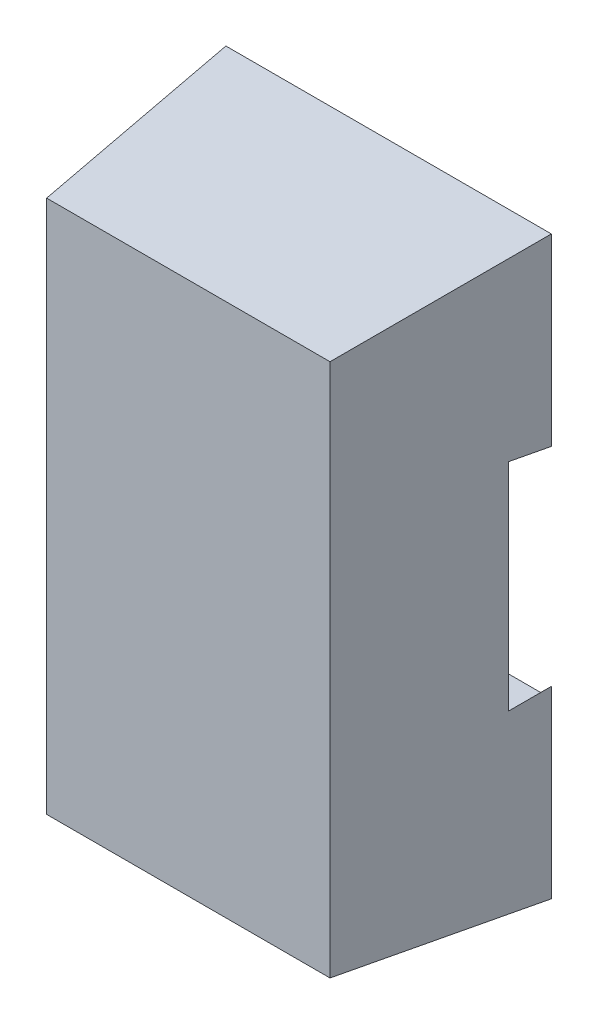
ISO-10303-21;
HEADER;
FILE_DESCRIPTION(('STEP AP214'),'2;1');
FILE_NAME('part.step','',(''),(''),'','','');
FILE_SCHEMA(('AUTOMOTIVE_DESIGN { 1 0 10303 214 1 1 1 1 }'));
ENDSEC;
DATA;
#1=APPLICATION_CONTEXT('core data for automotive mechanical design processes');
#2=APPLICATION_PROTOCOL_DEFINITION('international standard','automotive_design',2000,#1);
#3=PRODUCT_CONTEXT('',#1,'mechanical');
#4=PRODUCT('Part','Part','',(#3));
#5=PRODUCT_RELATED_PRODUCT_CATEGORY('part','',(#4));
#6=PRODUCT_DEFINITION_FORMATION('','',#4);
#7=PRODUCT_DEFINITION_CONTEXT('part definition',#1,'design');
#8=PRODUCT_DEFINITION('design','',#6,#7);
#9=PRODUCT_DEFINITION_SHAPE('','',#8);
#10=(LENGTH_UNIT() NAMED_UNIT(*) SI_UNIT(.MILLI.,.METRE.));
#11=(NAMED_UNIT(*) PLANE_ANGLE_UNIT() SI_UNIT($,.RADIAN.));
#12=(NAMED_UNIT(*) SI_UNIT($,.STERADIAN.) SOLID_ANGLE_UNIT());
#13=UNCERTAINTY_MEASURE_WITH_UNIT(LENGTH_MEASURE(1.E-05),#10,'distance_accuracy_value','');
#14=(GEOMETRIC_REPRESENTATION_CONTEXT(3) GLOBAL_UNCERTAINTY_ASSIGNED_CONTEXT((#13)) GLOBAL_UNIT_ASSIGNED_CONTEXT((#10,
#11,#12)) REPRESENTATION_CONTEXT('',''));
#15=CARTESIAN_POINT('',(0.,0.,0.));
#16=DIRECTION('',(0.,0.,1.));
#17=DIRECTION('',(1.,0.,0.));
#18=AXIS2_PLACEMENT_3D('',#15,#16,#17);
#19=CARTESIAN_POINT('',(0.3,1.04,0.));
#20=DIRECTION('',(1.,0.,0.));
#21=DIRECTION('',(0.,1.,0.));
#22=AXIS2_PLACEMENT_3D('',#19,#20,#21);
#23=PLANE('',#22);
#24=DIRECTION('',(0.,1.,0.));
#25=VECTOR('',#24,1.);
#26=CARTESIAN_POINT('',(0.3,1.04,0.31));
#27=LINE('',#26,#25);
#28=CARTESIAN_POINT('',(0.3,0.56,0.31));
#29=VERTEX_POINT('',#28);
#30=CARTESIAN_POINT('',(0.3,1.04,0.31));
#31=VERTEX_POINT('',#30);
#32=EDGE_CURVE('E231',#29,#31,#27,.T.);
#33=ORIENTED_EDGE('',*,*,#32,.T.);
#34=DIRECTION('',(0.,0.,1.));
#35=VECTOR('',#34,1.);
#36=CARTESIAN_POINT('',(0.3,1.04,0.));
#37=LINE('',#36,#35);
#38=CARTESIAN_POINT('',(0.3,1.04,0.));
#39=VERTEX_POINT('',#38);
#40=EDGE_CURVE('E236',#39,#31,#37,.T.);
#41=ORIENTED_EDGE('',*,*,#40,.F.);
#42=DIRECTION('',(0.,1.,0.));
#43=VECTOR('',#42,1.);
#44=CARTESIAN_POINT('',(0.3,0.,0.));
#45=LINE('',#44,#43);
#46=CARTESIAN_POINT('',(0.3,0.56,0.));
#47=VERTEX_POINT('',#46);
#48=EDGE_CURVE('E301',#39,#47,#45,.F.);
#49=ORIENTED_EDGE('',*,*,#48,.T.);
#50=DIRECTION('',(0.,0.,1.));
#51=VECTOR('',#50,1.);
#52=CARTESIAN_POINT('',(0.3,0.56,0.));
#53=LINE('',#52,#51);
#54=EDGE_CURVE('E226',#47,#29,#53,.T.);
#55=ORIENTED_EDGE('',*,*,#54,.T.);
#56=EDGE_LOOP('',(#33,#41,#49,#55));
#57=FACE_BOUND('',#56,.T.);
#58=ADVANCED_FACE('F17',(#57),#23,.F.);
#59=CARTESIAN_POINT('',(0.3,2.02,0.));
#60=DIRECTION('',(0.707106781186548,0.707106781186548,0.));
#61=DIRECTION('',(-0.707106781186548,0.707106781186548,0.));
#62=AXIS2_PLACEMENT_3D('',#59,#60,#61);
#63=PLANE('',#62);
#64=DIRECTION('',(0.,0.,1.));
#65=VECTOR('',#64,1.);
#66=CARTESIAN_POINT('',(0.935,1.385,0.));
#67=LINE('',#66,#65);
#68=CARTESIAN_POINT('',(0.935,1.385,0.31));
#69=VERTEX_POINT('',#68);
#70=CARTESIAN_POINT('',(0.935,1.385,0.));
#71=VERTEX_POINT('',#70);
#72=EDGE_CURVE('E20',#69,#71,#67,.F.);
#73=ORIENTED_EDGE('',*,*,#72,.T.);
#74=DIRECTION('',(-0.707106781186548,0.707106781186548,0.));
#75=VECTOR('',#74,1.);
#76=CARTESIAN_POINT('',(0.935,1.385,0.));
#77=LINE('',#76,#75);
#78=CARTESIAN_POINT('',(0.3,2.02,0.));
#79=VERTEX_POINT('',#78);
#80=EDGE_CURVE('E202',#71,#79,#77,.T.);
#81=ORIENTED_EDGE('',*,*,#80,.T.);
#82=DIRECTION('',(0.,0.,1.));
#83=VECTOR('',#82,1.);
#84=CARTESIAN_POINT('',(0.3,2.02,0.));
#85=LINE('',#84,#83);
#86=CARTESIAN_POINT('',(0.3,2.02,0.31));
#87=VERTEX_POINT('',#86);
#88=EDGE_CURVE('E238',#79,#87,#85,.T.);
#89=ORIENTED_EDGE('',*,*,#88,.T.);
#90=DIRECTION('',(0.707106781186548,-0.707106781186548,0.));
#91=VECTOR('',#90,1.);
#92=CARTESIAN_POINT('',(0.3,2.02,0.31));
#93=LINE('',#92,#91);
#94=EDGE_CURVE('E205',#87,#69,#93,.T.);
#95=ORIENTED_EDGE('',*,*,#94,.T.);
#96=EDGE_LOOP('',(#73,#81,#89,#95));
#97=FACE_BOUND('',#96,.T.);
#98=ADVANCED_FACE('F200',(#97),#63,.T.);
#99=CARTESIAN_POINT('',(0.3,1.385,0.));
#100=DIRECTION('',(0.,-1.,0.));
#101=DIRECTION('',(1.,0.,0.));
#102=AXIS2_PLACEMENT_3D('',#99,#100,#101);
#103=PLANE('',#102);
#104=DIRECTION('',(0.,0.,1.));
#105=VECTOR('',#104,1.);
#106=CARTESIAN_POINT('',(2.515,1.385,0.));
#107=LINE('',#106,#105);
#108=CARTESIAN_POINT('',(2.515,1.385,0.));
#109=VERTEX_POINT('',#108);
#110=CARTESIAN_POINT('',(2.515,1.385,0.31));
#111=VERTEX_POINT('',#110);
#112=EDGE_CURVE('E192',#109,#111,#107,.T.);
#113=ORIENTED_EDGE('',*,*,#112,.F.);
#114=DIRECTION('',(1.,0.,0.));
#115=VECTOR('',#114,1.);
#116=CARTESIAN_POINT('',(0.,1.385,0.));
#117=LINE('',#116,#115);
#118=EDGE_CURVE('E209',#109,#71,#117,.F.);
#119=ORIENTED_EDGE('',*,*,#118,.T.);
#120=ORIENTED_EDGE('',*,*,#72,.F.);
#121=DIRECTION('',(1.,0.,0.));
#122=VECTOR('',#121,1.);
#123=CARTESIAN_POINT('',(0.3,1.385,0.31));
#124=LINE('',#123,#122);
#125=EDGE_CURVE('E287',#69,#111,#124,.T.);
#126=ORIENTED_EDGE('',*,*,#125,.T.);
#127=EDGE_LOOP('',(#113,#119,#120,#126));
#128=FACE_BOUND('',#127,.T.);
#129=ADVANCED_FACE('F210',(#128),#103,.F.);
#130=CARTESIAN_POINT('',(0.935,3.215,0.));
#131=DIRECTION('',(0.707106781186548,-0.707106781186548,0.));
#132=DIRECTION('',(0.707106781186548,0.707106781186548,0.));
#133=AXIS2_PLACEMENT_3D('',#130,#131,#132);
#134=PLANE('',#133);
#135=DIRECTION('',(0.,0.,1.));
#136=VECTOR('',#135,1.);
#137=CARTESIAN_POINT('',(0.3,2.58,0.));
#138=LINE('',#137,#136);
#139=CARTESIAN_POINT('',(0.3,2.58,0.));
#140=VERTEX_POINT('',#139);
#141=CARTESIAN_POINT('',(0.3,2.58,0.31));
#142=VERTEX_POINT('',#141);
#143=EDGE_CURVE('E244',#140,#142,#138,.T.);
#144=ORIENTED_EDGE('',*,*,#143,.F.);
#145=DIRECTION('',(0.707106781186548,0.707106781186547,0.));
#146=VECTOR('',#145,1.);
#147=CARTESIAN_POINT('',(0.3,2.58,0.));
#148=LINE('',#147,#146);
#149=CARTESIAN_POINT('',(0.935,3.215,0.));
#150=VERTEX_POINT('',#149);
#151=EDGE_CURVE('E275',#140,#150,#148,.T.);
#152=ORIENTED_EDGE('',*,*,#151,.T.);
#153=DIRECTION('',(0.,0.,1.));
#154=VECTOR('',#153,1.);
#155=CARTESIAN_POINT('',(0.935,3.215,0.));
#156=LINE('',#155,#154);
#157=CARTESIAN_POINT('',(0.935,3.215,0.31));
#158=VERTEX_POINT('',#157);
#159=EDGE_CURVE('E176',#158,#150,#156,.F.);
#160=ORIENTED_EDGE('',*,*,#159,.F.);
#161=DIRECTION('',(-0.707106781186548,-0.707106781186547,0.));
#162=VECTOR('',#161,1.);
#163=CARTESIAN_POINT('',(0.935,3.215,0.31));
#164=LINE('',#163,#162);
#165=EDGE_CURVE('E290',#158,#142,#164,.T.);
#166=ORIENTED_EDGE('',*,*,#165,.T.);
#167=EDGE_LOOP('',(#144,#152,#160,#166));
#168=FACE_BOUND('',#167,.T.);
#169=ADVANCED_FACE('F415',(#168),#134,.T.);
#170=CARTESIAN_POINT('',(0.3,3.215,0.));
#171=DIRECTION('',(0.,-1.,0.));
#172=DIRECTION('',(1.,0.,0.));
#173=AXIS2_PLACEMENT_3D('',#170,#171,#172);
#174=PLANE('',#173);
#175=DIRECTION('',(0.,0.,1.));
#176=VECTOR('',#175,1.);
#177=CARTESIAN_POINT('',(2.515,3.215,0.));
#178=LINE('',#177,#176);
#179=CARTESIAN_POINT('',(2.515,3.215,0.31));
#180=VERTEX_POINT('',#179);
#181=CARTESIAN_POINT('',(2.515,3.215,0.));
#182=VERTEX_POINT('',#181);
#183=EDGE_CURVE('E296',#180,#182,#178,.F.);
#184=ORIENTED_EDGE('',*,*,#183,.F.);
#185=DIRECTION('',(1.,0.,0.));
#186=VECTOR('',#185,1.);
#187=CARTESIAN_POINT('',(0.3,3.215,0.31));
#188=LINE('',#187,#186);
#189=EDGE_CURVE('E293',#180,#158,#188,.F.);
#190=ORIENTED_EDGE('',*,*,#189,.T.);
#191=ORIENTED_EDGE('',*,*,#159,.T.);
#192=DIRECTION('',(1.,0.,0.));
#193=VECTOR('',#192,1.);
#194=CARTESIAN_POINT('',(0.,3.215,0.));
#195=LINE('',#194,#193);
#196=EDGE_CURVE('E273',#150,#182,#195,.T.);
#197=ORIENTED_EDGE('',*,*,#196,.T.);
#198=EDGE_LOOP('',(#184,#190,#191,#197));
#199=FACE_BOUND('',#198,.T.);
#200=ADVANCED_FACE('F413',(#199),#174,.T.);
#201=CARTESIAN_POINT('',(0.3,4.04,0.));
#202=DIRECTION('',(1.,0.,0.));
#203=DIRECTION('',(0.,1.,0.));
#204=AXIS2_PLACEMENT_3D('',#201,#202,#203);
#205=PLANE('',#204);
#206=DIRECTION('',(0.,1.,0.));
#207=VECTOR('',#206,1.);
#208=CARTESIAN_POINT('',(0.3,4.04,0.31));
#209=LINE('',#208,#207);
#210=CARTESIAN_POINT('',(0.3,3.56,0.31));
#211=VERTEX_POINT('',#210);
#212=CARTESIAN_POINT('',(0.3,4.04,0.31));
#213=VERTEX_POINT('',#212);
#214=EDGE_CURVE('E163',#211,#213,#209,.T.);
#215=ORIENTED_EDGE('',*,*,#214,.T.);
#216=DIRECTION('',(0.,0.,1.));
#217=VECTOR('',#216,1.);
#218=CARTESIAN_POINT('',(0.3,4.04,0.));
#219=LINE('',#218,#217);
#220=CARTESIAN_POINT('',(0.3,4.04,0.));
#221=VERTEX_POINT('',#220);
#222=EDGE_CURVE('E168',#221,#213,#219,.T.);
#223=ORIENTED_EDGE('',*,*,#222,.F.);
#224=DIRECTION('',(0.,1.,0.));
#225=VECTOR('',#224,1.);
#226=CARTESIAN_POINT('',(0.3,0.,0.));
#227=LINE('',#226,#225);
#228=CARTESIAN_POINT('',(0.3,3.56,0.));
#229=VERTEX_POINT('',#228);
#230=EDGE_CURVE('E268',#221,#229,#227,.F.);
#231=ORIENTED_EDGE('',*,*,#230,.T.);
#232=DIRECTION('',(0.,0.,1.));
#233=VECTOR('',#232,1.);
#234=CARTESIAN_POINT('',(0.3,3.56,0.));
#235=LINE('',#234,#233);
#236=EDGE_CURVE('E180',#229,#211,#235,.T.);
#237=ORIENTED_EDGE('',*,*,#236,.T.);
#238=EDGE_LOOP('',(#215,#223,#231,#237));
#239=FACE_BOUND('',#238,.T.);
#240=ADVANCED_FACE('F178',(#239),#205,.F.);
#241=CARTESIAN_POINT('',(-0.9,4.04,0.));
#242=DIRECTION('',(0.,-1.,0.));
#243=DIRECTION('',(1.,0.,0.));
#244=AXIS2_PLACEMENT_3D('',#241,#242,#243);
#245=PLANE('',#244);
#246=DIRECTION('',(1.,0.,0.));
#247=VECTOR('',#246,1.);
#248=CARTESIAN_POINT('',(0.,4.04,0.));
#249=LINE('',#248,#247);
#250=CARTESIAN_POINT('',(0.,4.04,0.));
#251=VERTEX_POINT('',#250);
#252=EDGE_CURVE('E173',#251,#221,#249,.T.);
#253=ORIENTED_EDGE('',*,*,#252,.T.);
#254=ORIENTED_EDGE('',*,*,#222,.T.);
#255=DIRECTION('',(1.,0.,0.));
#256=VECTOR('',#255,1.);
#257=CARTESIAN_POINT('',(-0.9,4.04,0.31));
#258=LINE('',#257,#256);
#259=CARTESIAN_POINT('',(0.0325823129323888,4.04,0.309999999999997));
#260=VERTEX_POINT('',#259);
#261=EDGE_CURVE('E171',#213,#260,#258,.F.);
#262=ORIENTED_EDGE('',*,*,#261,.T.);
#263=DIRECTION('',(0.104528463268025,0.,0.994521895368234));
#264=VECTOR('',#263,1.);
#265=CARTESIAN_POINT('',(0.,4.04,0.));
#266=LINE('',#265,#264);
#267=EDGE_CURVE('E260',#251,#260,#266,.T.);
#268=ORIENTED_EDGE('',*,*,#267,.F.);
#269=EDGE_LOOP('',(#253,#254,#262,#268));
#270=FACE_BOUND('',#269,.T.);
#271=ADVANCED_FACE('F169',(#270),#245,.T.);
#272=CARTESIAN_POINT('',(-0.9,4.04,0.31));
#273=DIRECTION('',(0.,0.,1.));
#274=DIRECTION('',(1.,0.,0.));
#275=AXIS2_PLACEMENT_3D('',#272,#273,#274);
#276=PLANE('',#275);
#277=DIRECTION('',(1.,0.,0.));
#278=VECTOR('',#277,1.);
#279=CARTESIAN_POINT('',(-0.9,3.56,0.31));
#280=LINE('',#279,#278);
#281=CARTESIAN_POINT('',(0.0325823129323888,3.56,0.309999999999997));
#282=VERTEX_POINT('',#281);
#283=EDGE_CURVE('E182',#211,#282,#280,.F.);
#284=ORIENTED_EDGE('',*,*,#283,.T.);
#285=DIRECTION('',(0.,1.,0.));
#286=VECTOR('',#285,1.);
#287=CARTESIAN_POINT('',(0.0325823129324754,0.,0.309999999999988));
#288=LINE('',#287,#286);
#289=EDGE_CURVE('E186',#260,#282,#288,.F.);
#290=ORIENTED_EDGE('',*,*,#289,.F.);
#291=ORIENTED_EDGE('',*,*,#261,.F.);
#292=ORIENTED_EDGE('',*,*,#214,.F.);
#293=EDGE_LOOP('',(#284,#290,#291,#292));
#294=FACE_BOUND('',#293,.T.);
#295=ADVANCED_FACE('F184',(#294),#276,.F.);
#296=CARTESIAN_POINT('',(-0.9,3.56,0.));
#297=DIRECTION('',(0.,-1.,0.));
#298=DIRECTION('',(1.,0.,0.));
#299=AXIS2_PLACEMENT_3D('',#296,#297,#298);
#300=PLANE('',#299);
#301=DIRECTION('',(1.,0.,0.));
#302=VECTOR('',#301,1.);
#303=CARTESIAN_POINT('',(0.,3.56,0.));
#304=LINE('',#303,#302);
#305=CARTESIAN_POINT('',(0.,3.56,0.));
#306=VERTEX_POINT('',#305);
#307=EDGE_CURVE('E252',#229,#306,#304,.F.);
#308=ORIENTED_EDGE('',*,*,#307,.T.);
#309=DIRECTION('',(0.104528463268025,0.,0.994521895368234));
#310=VECTOR('',#309,1.);
#311=CARTESIAN_POINT('',(0.,3.56,0.));
#312=LINE('',#311,#310);
#313=EDGE_CURVE('E249',#282,#306,#312,.F.);
#314=ORIENTED_EDGE('',*,*,#313,.F.);
#315=ORIENTED_EDGE('',*,*,#283,.F.);
#316=ORIENTED_EDGE('',*,*,#236,.F.);
#317=EDGE_LOOP('',(#308,#314,#315,#316));
#318=FACE_BOUND('',#317,.T.);
#319=ADVANCED_FACE('F250',(#318),#300,.F.);
#320=CARTESIAN_POINT('',(-0.9,2.58,0.));
#321=DIRECTION('',(0.,-1.,0.));
#322=DIRECTION('',(1.,0.,0.));
#323=AXIS2_PLACEMENT_3D('',#320,#321,#322);
#324=PLANE('',#323);
#325=DIRECTION('',(1.,0.,0.));
#326=VECTOR('',#325,1.);
#327=CARTESIAN_POINT('',(0.,2.58,0.));
#328=LINE('',#327,#326);
#329=CARTESIAN_POINT('',(0.,2.58,0.));
#330=VERTEX_POINT('',#329);
#331=EDGE_CURVE('E277',#330,#140,#328,.T.);
#332=ORIENTED_EDGE('',*,*,#331,.T.);
#333=ORIENTED_EDGE('',*,*,#143,.T.);
#334=DIRECTION('',(1.,0.,0.));
#335=VECTOR('',#334,1.);
#336=CARTESIAN_POINT('',(-0.9,2.58,0.31));
#337=LINE('',#336,#335);
#338=CARTESIAN_POINT('',(0.0325823129323888,2.58,0.309999999999997));
#339=VERTEX_POINT('',#338);
#340=EDGE_CURVE('E242',#142,#339,#337,.F.);
#341=ORIENTED_EDGE('',*,*,#340,.T.);
#342=DIRECTION('',(0.104528463268025,0.,0.994521895368234));
#343=VECTOR('',#342,1.);
#344=CARTESIAN_POINT('',(0.,2.58,0.));
#345=LINE('',#344,#343);
#346=EDGE_CURVE('E337',#330,#339,#345,.T.);
#347=ORIENTED_EDGE('',*,*,#346,.F.);
#348=EDGE_LOOP('',(#332,#333,#341,#347));
#349=FACE_BOUND('',#348,.T.);
#350=ADVANCED_FACE('F345',(#349),#324,.T.);
#351=CARTESIAN_POINT('',(-0.9,2.02,0.));
#352=DIRECTION('',(0.,-1.,0.));
#353=DIRECTION('',(1.,0.,0.));
#354=AXIS2_PLACEMENT_3D('',#351,#352,#353);
#355=PLANE('',#354);
#356=DIRECTION('',(1.,0.,0.));
#357=VECTOR('',#356,1.);
#358=CARTESIAN_POINT('',(0.,2.02,0.));
#359=LINE('',#358,#357);
#360=CARTESIAN_POINT('',(0.,2.02,0.));
#361=VERTEX_POINT('',#360);
#362=EDGE_CURVE('E219',#79,#361,#359,.F.);
#363=ORIENTED_EDGE('',*,*,#362,.T.);
#364=DIRECTION('',(0.104528463268025,0.,0.994521895368234));
#365=VECTOR('',#364,1.);
#366=CARTESIAN_POINT('',(0.,2.02,0.));
#367=LINE('',#366,#365);
#368=CARTESIAN_POINT('',(0.0325823129323888,2.02,0.309999999999997));
#369=VERTEX_POINT('',#368);
#370=EDGE_CURVE('E329',#369,#361,#367,.F.);
#371=ORIENTED_EDGE('',*,*,#370,.F.);
#372=DIRECTION('',(1.,0.,0.));
#373=VECTOR('',#372,1.);
#374=CARTESIAN_POINT('',(-0.9,2.02,0.31));
#375=LINE('',#374,#373);
#376=EDGE_CURVE('E240',#87,#369,#375,.F.);
#377=ORIENTED_EDGE('',*,*,#376,.F.);
#378=ORIENTED_EDGE('',*,*,#88,.F.);
#379=EDGE_LOOP('',(#363,#371,#377,#378));
#380=FACE_BOUND('',#379,.T.);
#381=ADVANCED_FACE('F354',(#380),#355,.F.);
#382=CARTESIAN_POINT('',(-0.9,1.04,0.));
#383=DIRECTION('',(0.,-1.,0.));
#384=DIRECTION('',(1.,0.,0.));
#385=AXIS2_PLACEMENT_3D('',#382,#383,#384);
#386=PLANE('',#385);
#387=DIRECTION('',(1.,0.,0.));
#388=VECTOR('',#387,1.);
#389=CARTESIAN_POINT('',(0.,1.04,0.));
#390=LINE('',#389,#388);
#391=CARTESIAN_POINT('',(0.,1.04,0.));
#392=VERTEX_POINT('',#391);
#393=EDGE_CURVE('E221',#392,#39,#390,.T.);
#394=ORIENTED_EDGE('',*,*,#393,.T.);
#395=ORIENTED_EDGE('',*,*,#40,.T.);
#396=DIRECTION('',(1.,0.,0.));
#397=VECTOR('',#396,1.);
#398=CARTESIAN_POINT('',(-0.9,1.04,0.31));
#399=LINE('',#398,#397);
#400=CARTESIAN_POINT('',(0.0325823129323888,1.04,0.309999999999997));
#401=VERTEX_POINT('',#400);
#402=EDGE_CURVE('E234',#31,#401,#399,.F.);
#403=ORIENTED_EDGE('',*,*,#402,.T.);
#404=DIRECTION('',(0.104528463268025,0.,0.994521895368234));
#405=VECTOR('',#404,1.);
#406=CARTESIAN_POINT('',(0.,1.04,0.));
#407=LINE('',#406,#405);
#408=EDGE_CURVE('E307',#392,#401,#407,.T.);
#409=ORIENTED_EDGE('',*,*,#408,.F.);
#410=EDGE_LOOP('',(#394,#395,#403,#409));
#411=FACE_BOUND('',#410,.T.);
#412=ADVANCED_FACE('F305',(#411),#386,.T.);
#413=CARTESIAN_POINT('',(-0.9,1.04,0.31));
#414=DIRECTION('',(0.,0.,1.));
#415=DIRECTION('',(1.,0.,0.));
#416=AXIS2_PLACEMENT_3D('',#413,#414,#415);
#417=PLANE('',#416);
#418=DIRECTION('',(1.,0.,0.));
#419=VECTOR('',#418,1.);
#420=CARTESIAN_POINT('',(-0.9,0.56,0.31));
#421=LINE('',#420,#419);
#422=CARTESIAN_POINT('',(0.0325823129323888,0.56,0.309999999999997));
#423=VERTEX_POINT('',#422);
#424=EDGE_CURVE('E229',#29,#423,#421,.F.);
#425=ORIENTED_EDGE('',*,*,#424,.T.);
#426=DIRECTION('',(0.,1.,0.));
#427=VECTOR('',#426,1.);
#428=CARTESIAN_POINT('',(0.0325823129324754,0.,0.309999999999988));
#429=LINE('',#428,#427);
#430=EDGE_CURVE('E324',#401,#423,#429,.F.);
#431=ORIENTED_EDGE('',*,*,#430,.F.);
#432=ORIENTED_EDGE('',*,*,#402,.F.);
#433=ORIENTED_EDGE('',*,*,#32,.F.);
#434=EDGE_LOOP('',(#425,#431,#432,#433));
#435=FACE_BOUND('',#434,.T.);
#436=ADVANCED_FACE('F322',(#435),#417,.F.);
#437=CARTESIAN_POINT('',(-0.9,0.56,0.));
#438=DIRECTION('',(0.,-1.,0.));
#439=DIRECTION('',(1.,0.,0.));
#440=AXIS2_PLACEMENT_3D('',#437,#438,#439);
#441=PLANE('',#440);
#442=DIRECTION('',(1.,0.,0.));
#443=VECTOR('',#442,1.);
#444=CARTESIAN_POINT('',(0.,0.56,0.));
#445=LINE('',#444,#443);
#446=CARTESIAN_POINT('',(0.,0.56,0.));
#447=VERTEX_POINT('',#446);
#448=EDGE_CURVE('E299',#47,#447,#445,.F.);
#449=ORIENTED_EDGE('',*,*,#448,.T.);
#450=DIRECTION('',(0.104528463268025,0.,0.994521895368234));
#451=VECTOR('',#450,1.);
#452=CARTESIAN_POINT('',(0.,0.56,0.));
#453=LINE('',#452,#451);
#454=EDGE_CURVE('E318',#423,#447,#453,.F.);
#455=ORIENTED_EDGE('',*,*,#454,.F.);
#456=ORIENTED_EDGE('',*,*,#424,.F.);
#457=ORIENTED_EDGE('',*,*,#54,.F.);
#458=EDGE_LOOP('',(#449,#455,#456,#457));
#459=FACE_BOUND('',#458,.T.);
#460=ADVANCED_FACE('F315',(#459),#441,.F.);
#461=CARTESIAN_POINT('',(0.,0.,0.));
#462=DIRECTION('',(0.,0.,1.));
#463=DIRECTION('',(1.,0.,0.));
#464=AXIS2_PLACEMENT_3D('',#461,#462,#463);
#465=PLANE('',#464);
#466=ORIENTED_EDGE('',*,*,#48,.F.);
#467=ORIENTED_EDGE('',*,*,#393,.F.);
#468=DIRECTION('',(0.,1.,0.));
#469=VECTOR('',#468,1.);
#470=CARTESIAN_POINT('',(0.,0.,0.));
#471=LINE('',#470,#469);
#472=EDGE_CURVE('E327',#361,#392,#471,.F.);
#473=ORIENTED_EDGE('',*,*,#472,.F.);
#474=ORIENTED_EDGE('',*,*,#362,.F.);
#475=ORIENTED_EDGE('',*,*,#80,.F.);
#476=ORIENTED_EDGE('',*,*,#118,.F.);
#477=DIRECTION('',(-0.707106781186548,-0.707106781186548,0.));
#478=VECTOR('',#477,1.);
#479=CARTESIAN_POINT('',(2.515,1.385,0.));
#480=LINE('',#479,#478);
#481=CARTESIAN_POINT('',(2.6,1.47,0.));
#482=VERTEX_POINT('',#481);
#483=EDGE_CURVE('E282',#482,#109,#480,.T.);
#484=ORIENTED_EDGE('',*,*,#483,.F.);
#485=DIRECTION('',(0.,1.,0.));
#486=VECTOR('',#485,1.);
#487=CARTESIAN_POINT('',(2.6,0.,0.));
#488=LINE('',#487,#486);
#489=CARTESIAN_POINT('',(2.6,0.,0.));
#490=VERTEX_POINT('',#489);
#491=EDGE_CURVE('E213',#490,#482,#488,.T.);
#492=ORIENTED_EDGE('',*,*,#491,.F.);
#493=DIRECTION('',(1.,0.,0.));
#494=VECTOR('',#493,1.);
#495=CARTESIAN_POINT('',(0.,0.,0.));
#496=LINE('',#495,#494);
#497=CARTESIAN_POINT('',(0.,0.,0.));
#498=VERTEX_POINT('',#497);
#499=EDGE_CURVE('E379',#490,#498,#496,.F.);
#500=ORIENTED_EDGE('',*,*,#499,.T.);
#501=DIRECTION('',(0.,1.,0.));
#502=VECTOR('',#501,1.);
#503=CARTESIAN_POINT('',(0.,0.,0.));
#504=LINE('',#503,#502);
#505=EDGE_CURVE('E381',#447,#498,#504,.F.);
#506=ORIENTED_EDGE('',*,*,#505,.F.);
#507=ORIENTED_EDGE('',*,*,#448,.F.);
#508=EDGE_LOOP('',(#466,#467,#473,#474,#475,#476,#484,#492,#500,#506,#507));
#509=FACE_BOUND('',#508,.T.);
#510=ADVANCED_FACE('F217',(#509),#465,.F.);
#511=CARTESIAN_POINT('',(3.15,2.58,0.));
#512=DIRECTION('',(-0.707106781186548,-0.707106781186548,0.));
#513=DIRECTION('',(0.707106781186548,-0.707106781186548,0.));
#514=AXIS2_PLACEMENT_3D('',#511,#512,#513);
#515=PLANE('',#514);
#516=DIRECTION('',(-0.707106781186548,0.707106781186548,0.));
#517=VECTOR('',#516,1.);
#518=CARTESIAN_POINT('',(2.567417687068,3.162582312932,0.31));
#519=LINE('',#518,#517);
#520=CARTESIAN_POINT('',(2.56741768706788,3.162582312932,0.309999999999988));
#521=VERTEX_POINT('',#520);
#522=EDGE_CURVE('E284',#521,#180,#519,.T.);
#523=ORIENTED_EDGE('',*,*,#522,.T.);
#524=ORIENTED_EDGE('',*,*,#183,.T.);
#525=DIRECTION('',(0.707106781186548,-0.707106781186548,0.));
#526=VECTOR('',#525,1.);
#527=CARTESIAN_POINT('',(2.515,3.215,0.));
#528=LINE('',#527,#526);
#529=CARTESIAN_POINT('',(2.6,3.13,0.));
#530=VERTEX_POINT('',#529);
#531=EDGE_CURVE('E271',#182,#530,#528,.T.);
#532=ORIENTED_EDGE('',*,*,#531,.T.);
#533=DIRECTION('',(-0.103962051184879,0.103962051183375,0.989132844377932));
#534=VECTOR('',#533,1.);
#535=CARTESIAN_POINT('',(2.6,3.13,0.));
#536=LINE('',#535,#534);
#537=EDGE_CURVE('E369',#530,#521,#536,.T.);
#538=ORIENTED_EDGE('',*,*,#537,.T.);
#539=EDGE_LOOP('',(#523,#524,#532,#538));
#540=FACE_BOUND('',#539,.T.);
#541=ADVANCED_FACE('F410',(#540),#515,.T.);
#542=CARTESIAN_POINT('',(0.3,3.215,0.31));
#543=DIRECTION('',(0.,0.,1.));
#544=DIRECTION('',(1.,0.,0.));
#545=AXIS2_PLACEMENT_3D('',#542,#543,#544);
#546=PLANE('',#545);
#547=DIRECTION('',(0.,1.,0.));
#548=VECTOR('',#547,1.);
#549=CARTESIAN_POINT('',(2.56741768706753,0.,0.30999999999995));
#550=LINE('',#549,#548);
#551=CARTESIAN_POINT('',(2.56741768706788,1.437417687068,0.309999999999988));
#552=VERTEX_POINT('',#551);
#553=EDGE_CURVE('E358',#521,#552,#550,.F.);
#554=ORIENTED_EDGE('',*,*,#553,.T.);
#555=DIRECTION('',(-0.707106781186548,-0.707106781186548,0.));
#556=VECTOR('',#555,1.);
#557=CARTESIAN_POINT('',(2.515,1.385,0.31));
#558=LINE('',#557,#556);
#559=EDGE_CURVE('E280',#111,#552,#558,.F.);
#560=ORIENTED_EDGE('',*,*,#559,.F.);
#561=ORIENTED_EDGE('',*,*,#125,.F.);
#562=ORIENTED_EDGE('',*,*,#94,.F.);
#563=ORIENTED_EDGE('',*,*,#376,.T.);
#564=DIRECTION('',(0.,1.,0.));
#565=VECTOR('',#564,1.);
#566=CARTESIAN_POINT('',(0.0325823129324754,0.,0.309999999999988));
#567=LINE('',#566,#565);
#568=EDGE_CURVE('E334',#339,#369,#567,.F.);
#569=ORIENTED_EDGE('',*,*,#568,.F.);
#570=ORIENTED_EDGE('',*,*,#340,.F.);
#571=ORIENTED_EDGE('',*,*,#165,.F.);
#572=ORIENTED_EDGE('',*,*,#189,.F.);
#573=ORIENTED_EDGE('',*,*,#522,.F.);
#574=EDGE_LOOP('',(#554,#560,#561,#562,#563,#569,#570,#571,#572,#573));
#575=FACE_BOUND('',#574,.T.);
#576=ADVANCED_FACE('F350',(#575),#546,.F.);
#577=CARTESIAN_POINT('',(2.515,1.385,0.));
#578=DIRECTION('',(-0.707106781186548,0.707106781186548,0.));
#579=DIRECTION('',(-0.707106781186548,-0.707106781186548,0.));
#580=AXIS2_PLACEMENT_3D('',#577,#578,#579);
#581=PLANE('',#580);
#582=ORIENTED_EDGE('',*,*,#559,.T.);
#583=DIRECTION('',(0.103962051184879,0.103962051183375,-0.989132844377932));
#584=VECTOR('',#583,1.);
#585=CARTESIAN_POINT('',(2.56741768706753,1.437417687068,0.30999999999995));
#586=LINE('',#585,#584);
#587=EDGE_CURVE('E362',#552,#482,#586,.T.);
#588=ORIENTED_EDGE('',*,*,#587,.T.);
#589=ORIENTED_EDGE('',*,*,#483,.T.);
#590=ORIENTED_EDGE('',*,*,#112,.T.);
#591=EDGE_LOOP('',(#582,#588,#589,#590));
#592=FACE_BOUND('',#591,.T.);
#593=ADVANCED_FACE('F361',(#592),#581,.T.);
#594=CARTESIAN_POINT('',(0.,0.,0.));
#595=DIRECTION('',(0.,0.,1.));
#596=DIRECTION('',(1.,0.,0.));
#597=AXIS2_PLACEMENT_3D('',#594,#595,#596);
#598=PLANE('',#597);
#599=ORIENTED_EDGE('',*,*,#230,.F.);
#600=ORIENTED_EDGE('',*,*,#252,.F.);
#601=DIRECTION('',(0.,1.,0.));
#602=VECTOR('',#601,1.);
#603=CARTESIAN_POINT('',(0.,0.,0.));
#604=LINE('',#603,#602);
#605=CARTESIAN_POINT('',(0.,4.6,0.));
#606=VERTEX_POINT('',#605);
#607=EDGE_CURVE('E262',#606,#251,#604,.F.);
#608=ORIENTED_EDGE('',*,*,#607,.F.);
#609=DIRECTION('',(1.,0.,0.));
#610=VECTOR('',#609,1.);
#611=CARTESIAN_POINT('',(0.,4.6,0.));
#612=LINE('',#611,#610);
#613=CARTESIAN_POINT('',(2.6,4.6,0.));
#614=VERTEX_POINT('',#613);
#615=EDGE_CURVE('E400',#614,#606,#612,.F.);
#616=ORIENTED_EDGE('',*,*,#615,.F.);
#617=DIRECTION('',(0.,1.,0.));
#618=VECTOR('',#617,1.);
#619=CARTESIAN_POINT('',(2.6,0.,0.));
#620=LINE('',#619,#618);
#621=EDGE_CURVE('E374',#614,#530,#620,.F.);
#622=ORIENTED_EDGE('',*,*,#621,.T.);
#623=ORIENTED_EDGE('',*,*,#531,.F.);
#624=ORIENTED_EDGE('',*,*,#196,.F.);
#625=ORIENTED_EDGE('',*,*,#151,.F.);
#626=ORIENTED_EDGE('',*,*,#331,.F.);
#627=DIRECTION('',(0.,1.,0.));
#628=VECTOR('',#627,1.);
#629=CARTESIAN_POINT('',(0.,0.,0.));
#630=LINE('',#629,#628);
#631=EDGE_CURVE('E256',#306,#330,#630,.F.);
#632=ORIENTED_EDGE('',*,*,#631,.F.);
#633=ORIENTED_EDGE('',*,*,#307,.F.);
#634=EDGE_LOOP('',(#599,#600,#608,#616,#622,#623,#624,#625,#626,#632,#633));
#635=FACE_BOUND('',#634,.T.);
#636=ADVANCED_FACE('F341',(#635),#598,.F.);
#637=CARTESIAN_POINT('',(0.,0.,0.));
#638=DIRECTION('',(-0.994521895368234,0.,0.104528463268025));
#639=DIRECTION('',(0.104528463268025,0.,0.994521895368234));
#640=AXIS2_PLACEMENT_3D('',#637,#638,#639);
#641=PLANE('',#640);
#642=DIRECTION('',(0.103962051184448,0.103962051184867,0.98913284437782));
#643=VECTOR('',#642,1.);
#644=CARTESIAN_POINT('',(0.,0.,0.));
#645=LINE('',#644,#643);
#646=CARTESIAN_POINT('',(0.168166776425339,0.16816677642517,1.59999999999995));
#647=VERTEX_POINT('',#646);
#648=EDGE_CURVE('E377',#498,#647,#645,.T.);
#649=ORIENTED_EDGE('',*,*,#648,.T.);
#650=DIRECTION('',(0.,1.,0.));
#651=VECTOR('',#650,1.);
#652=CARTESIAN_POINT('',(0.168166776425,0.,1.6));
#653=LINE('',#652,#651);
#654=CARTESIAN_POINT('',(0.168166776425339,4.43183322357483,1.59999999999995));
#655=VERTEX_POINT('',#654);
#656=EDGE_CURVE('E393',#655,#647,#653,.F.);
#657=ORIENTED_EDGE('',*,*,#656,.F.);
#658=DIRECTION('',(0.103962051184448,-0.103962051184868,0.98913284437782));
#659=VECTOR('',#658,1.);
#660=CARTESIAN_POINT('',(0.,4.6,0.));
#661=LINE('',#660,#659);
#662=EDGE_CURVE('E398',#606,#655,#661,.T.);
#663=ORIENTED_EDGE('',*,*,#662,.F.);
#664=ORIENTED_EDGE('',*,*,#607,.T.);
#665=ORIENTED_EDGE('',*,*,#267,.T.);
#666=ORIENTED_EDGE('',*,*,#289,.T.);
#667=ORIENTED_EDGE('',*,*,#313,.T.);
#668=ORIENTED_EDGE('',*,*,#631,.T.);
#669=ORIENTED_EDGE('',*,*,#346,.T.);
#670=ORIENTED_EDGE('',*,*,#568,.T.);
#671=ORIENTED_EDGE('',*,*,#370,.T.);
#672=ORIENTED_EDGE('',*,*,#472,.T.);
#673=ORIENTED_EDGE('',*,*,#408,.T.);
#674=ORIENTED_EDGE('',*,*,#430,.T.);
#675=ORIENTED_EDGE('',*,*,#454,.T.);
#676=ORIENTED_EDGE('',*,*,#505,.T.);
#677=EDGE_LOOP('',(#649,#657,#663,#664,#665,#666,#667,#668,#669,#670,#671,#672,#673,#674,#675,#676));
#678=FACE_BOUND('',#677,.T.);
#679=ADVANCED_FACE('F258',(#678),#641,.T.);
#680=CARTESIAN_POINT('',(0.,0.,0.));
#681=DIRECTION('',(0.,0.994521895368234,-0.104528463268025));
#682=DIRECTION('',(0.,0.104528463268025,0.994521895368234));
#683=AXIS2_PLACEMENT_3D('',#680,#681,#682);
#684=PLANE('',#683);
#685=ORIENTED_EDGE('',*,*,#648,.F.);
#686=ORIENTED_EDGE('',*,*,#499,.F.);
#687=DIRECTION('',(-0.103962051184867,0.103962051184448,0.98913284437782));
#688=VECTOR('',#687,1.);
#689=CARTESIAN_POINT('',(2.6,0.,0.));
#690=LINE('',#689,#688);
#691=CARTESIAN_POINT('',(2.43183322357483,0.168166776425339,1.59999999999995));
#692=VERTEX_POINT('',#691);
#693=EDGE_CURVE('E366',#490,#692,#690,.T.);
#694=ORIENTED_EDGE('',*,*,#693,.T.);
#695=DIRECTION('',(1.,0.,0.));
#696=VECTOR('',#695,1.);
#697=CARTESIAN_POINT('',(0.,0.168166776425,1.6));
#698=LINE('',#697,#696);
#699=EDGE_CURVE('E389',#647,#692,#698,.T.);
#700=ORIENTED_EDGE('',*,*,#699,.F.);
#701=EDGE_LOOP('',(#685,#686,#694,#700));
#702=FACE_BOUND('',#701,.T.);
#703=ADVANCED_FACE('F387',(#702),#684,.F.);
#704=CARTESIAN_POINT('',(2.6,0.,0.));
#705=DIRECTION('',(-0.994521895368234,0.,-0.104528463268025));
#706=DIRECTION('',(-0.104528463268025,0.,0.994521895368234));
#707=AXIS2_PLACEMENT_3D('',#704,#705,#706);
#708=PLANE('',#707);
#709=ORIENTED_EDGE('',*,*,#693,.F.);
#710=ORIENTED_EDGE('',*,*,#491,.T.);
#711=ORIENTED_EDGE('',*,*,#587,.F.);
#712=ORIENTED_EDGE('',*,*,#553,.F.);
#713=ORIENTED_EDGE('',*,*,#537,.F.);
#714=ORIENTED_EDGE('',*,*,#621,.F.);
#715=DIRECTION('',(0.103962051184448,0.103962051184868,-0.98913284437782));
#716=VECTOR('',#715,1.);
#717=CARTESIAN_POINT('',(2.431833223575,4.43183322357432,1.59999999999993));
#718=LINE('',#717,#716);
#719=CARTESIAN_POINT('',(2.43183322357466,4.43183322357483,1.59999999999995));
#720=VERTEX_POINT('',#719);
#721=EDGE_CURVE('E35',#720,#614,#718,.T.);
#722=ORIENTED_EDGE('',*,*,#721,.F.);
#723=DIRECTION('',(0.,1.,0.));
#724=VECTOR('',#723,1.);
#725=CARTESIAN_POINT('',(2.431833223575,0.,1.6));
#726=LINE('',#725,#724);
#727=EDGE_CURVE('E26',#692,#720,#726,.T.);
#728=ORIENTED_EDGE('',*,*,#727,.F.);
#729=EDGE_LOOP('',(#709,#710,#711,#712,#713,#714,#722,#728));
#730=FACE_BOUND('',#729,.T.);
#731=ADVANCED_FACE('F364',(#730),#708,.F.);
#732=CARTESIAN_POINT('',(0.,4.6,0.));
#733=DIRECTION('',(0.,0.994521895368234,0.104528463268025));
#734=DIRECTION('',(0.,-0.104528463268025,0.994521895368234));
#735=AXIS2_PLACEMENT_3D('',#732,#733,#734);
#736=PLANE('',#735);
#737=ORIENTED_EDGE('',*,*,#662,.T.);
#738=DIRECTION('',(1.,0.,0.));
#739=VECTOR('',#738,1.);
#740=CARTESIAN_POINT('',(0.,4.431833223575,1.6));
#741=LINE('',#740,#739);
#742=EDGE_CURVE('E11',#720,#655,#741,.F.);
#743=ORIENTED_EDGE('',*,*,#742,.F.);
#744=ORIENTED_EDGE('',*,*,#721,.T.);
#745=ORIENTED_EDGE('',*,*,#615,.T.);
#746=EDGE_LOOP('',(#737,#743,#744,#745));
#747=FACE_BOUND('',#746,.T.);
#748=ADVANCED_FACE('F406',(#747),#736,.T.);
#749=CARTESIAN_POINT('',(0.,0.,1.6));
#750=DIRECTION('',(0.,0.,1.));
#751=DIRECTION('',(1.,0.,0.));
#752=AXIS2_PLACEMENT_3D('',#749,#750,#751);
#753=PLANE('',#752);
#754=ORIENTED_EDGE('',*,*,#727,.T.);
#755=ORIENTED_EDGE('',*,*,#742,.T.);
#756=ORIENTED_EDGE('',*,*,#656,.T.);
#757=ORIENTED_EDGE('',*,*,#699,.T.);
#758=EDGE_LOOP('',(#754,#755,#756,#757));
#759=FACE_BOUND('',#758,.T.);
#760=ADVANCED_FACE('F395',(#759),#753,.T.);
#761=CLOSED_SHELL('',(#58,#98,#129,#169,#200,#240,#271,#295,#319,#350,#381,#412,#436,#460,#510,
#541,#576,#593,#636,#679,#703,#731,#748,#760));
#762=MANIFOLD_SOLID_BREP('B1',#761);
#763=ADVANCED_BREP_SHAPE_REPRESENTATION('',(#18,#762),#14);
#764=SHAPE_DEFINITION_REPRESENTATION(#9,#763);
ENDSEC;
END-ISO-10303-21;
